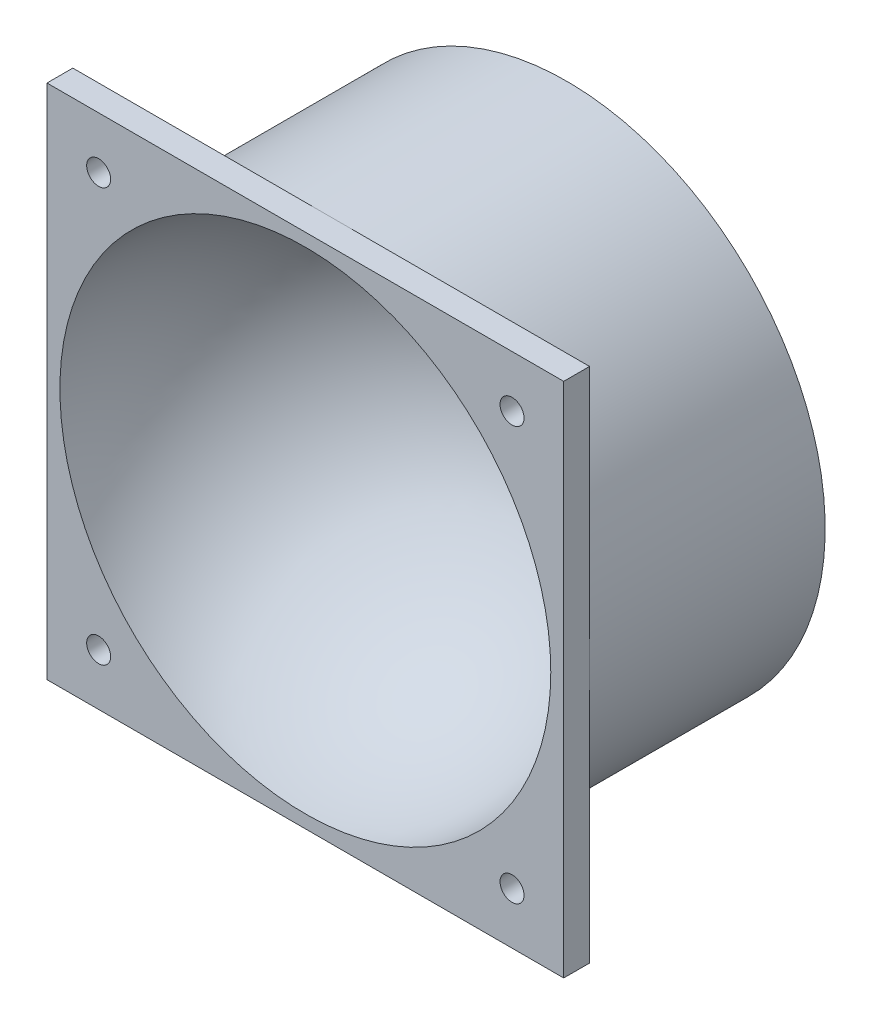
ISO-10303-21;
HEADER;
FILE_DESCRIPTION(('STEP AP214'),'2;1');
FILE_NAME('part.step','',(''),(''),'','','');
FILE_SCHEMA(('AUTOMOTIVE_DESIGN { 1 0 10303 214 1 1 1 1 }'));
ENDSEC;
DATA;
#1=APPLICATION_CONTEXT('core data for automotive mechanical design processes');
#2=APPLICATION_PROTOCOL_DEFINITION('international standard','automotive_design',2000,#1);
#3=PRODUCT_CONTEXT('',#1,'mechanical');
#4=PRODUCT('Part','Part','',(#3));
#5=PRODUCT_RELATED_PRODUCT_CATEGORY('part','',(#4));
#6=PRODUCT_DEFINITION_FORMATION('','',#4);
#7=PRODUCT_DEFINITION_CONTEXT('part definition',#1,'design');
#8=PRODUCT_DEFINITION('design','',#6,#7);
#9=PRODUCT_DEFINITION_SHAPE('','',#8);
#10=(LENGTH_UNIT() NAMED_UNIT(*) SI_UNIT(.MILLI.,.METRE.));
#11=(NAMED_UNIT(*) PLANE_ANGLE_UNIT() SI_UNIT($,.RADIAN.));
#12=(NAMED_UNIT(*) SI_UNIT($,.STERADIAN.) SOLID_ANGLE_UNIT());
#13=UNCERTAINTY_MEASURE_WITH_UNIT(LENGTH_MEASURE(1.E-05),#10,'distance_accuracy_value','');
#14=(GEOMETRIC_REPRESENTATION_CONTEXT(3) GLOBAL_UNCERTAINTY_ASSIGNED_CONTEXT((#13)) GLOBAL_UNIT_ASSIGNED_CONTEXT((#10,
#11,#12)) REPRESENTATION_CONTEXT('',''));
#15=CARTESIAN_POINT('',(0.,0.,0.));
#16=DIRECTION('',(0.,0.,1.));
#17=DIRECTION('',(1.,0.,0.));
#18=AXIS2_PLACEMENT_3D('',#15,#16,#17);
#19=CARTESIAN_POINT('',(0.,0.,3.17499999999998));
#20=DIRECTION('',(0.,0.,-1.));
#21=DIRECTION('',(-1.,0.,0.));
#22=AXIS2_PLACEMENT_3D('',#19,#20,#21);
#23=CYLINDRICAL_SURFACE('',#22,3.2639);
#24=CARTESIAN_POINT('',(0.,0.,-26.8103858244312));
#25=DIRECTION('',(0.,0.,1.));
#26=DIRECTION('',(1.,0.,0.));
#27=AXIS2_PLACEMENT_3D('',#24,#25,#26);
#28=CIRCLE('',#27,3.2639);
#29=CARTESIAN_POINT('',(3.26390000000001,0.,-26.8103858244312));
#30=VERTEX_POINT('',#29);
#31=EDGE_CURVE('E133',#30,#30,#28,.F.);
#32=ORIENTED_EDGE('',*,*,#31,.F.);
#33=EDGE_LOOP('',(#32));
#34=FACE_BOUND('',#33,.T.);
#35=CARTESIAN_POINT('',(0.,0.,-27.432));
#36=DIRECTION('',(0.,0.,-1.));
#37=DIRECTION('',(-1.,0.,0.));
#38=AXIS2_PLACEMENT_3D('',#35,#36,#37);
#39=CIRCLE('',#38,3.2639);
#40=CARTESIAN_POINT('',(-3.26390000000001,0.,-27.432));
#41=VERTEX_POINT('',#40);
#42=EDGE_CURVE('E38',#41,#41,#39,.F.);
#43=ORIENTED_EDGE('',*,*,#42,.F.);
#44=EDGE_LOOP('',(#43));
#45=FACE_BOUND('',#44,.T.);
#46=ADVANCED_FACE('F34',(#34,#45),#23,.F.);
#47=CARTESIAN_POINT('',(-31.75,-31.75,0.));
#48=DIRECTION('',(0.,0.,1.));
#49=DIRECTION('',(1.,0.,0.));
#50=AXIS2_PLACEMENT_3D('',#47,#48,#49);
#51=PLANE('',#50);
#52=CARTESIAN_POINT('',(-25.4,25.4,0.));
#53=DIRECTION('',(0.,0.,1.));
#54=DIRECTION('',(1.,0.,0.));
#55=AXIS2_PLACEMENT_3D('',#52,#53,#54);
#56=CIRCLE('',#55,1.4732);
#57=CARTESIAN_POINT('',(-23.9268,25.4,0.));
#58=VERTEX_POINT('',#57);
#59=EDGE_CURVE('E157',#58,#58,#56,.T.);
#60=ORIENTED_EDGE('',*,*,#59,.T.);
#61=EDGE_LOOP('',(#60));
#62=FACE_BOUND('',#61,.T.);
#63=CARTESIAN_POINT('',(0.,0.,0.));
#64=DIRECTION('',(0.,0.,-1.));
#65=DIRECTION('',(-1.,0.,0.));
#66=AXIS2_PLACEMENT_3D('',#63,#64,#65);
#67=CIRCLE('',#66,31.75);
#68=CARTESIAN_POINT('',(-31.7500000000001,0.,0.));
#69=VERTEX_POINT('',#68);
#70=CARTESIAN_POINT('',(0.,31.75,0.));
#71=VERTEX_POINT('',#70);
#72=EDGE_CURVE('E45',#69,#71,#67,.T.);
#73=ORIENTED_EDGE('',*,*,#72,.F.);
#74=DIRECTION('',(0.,-1.,0.));
#75=VECTOR('',#74,1.);
#76=CARTESIAN_POINT('',(-31.75,31.75,0.));
#77=LINE('',#76,#75);
#78=CARTESIAN_POINT('',(-31.75,31.75,0.));
#79=VERTEX_POINT('',#78);
#80=EDGE_CURVE('E164',#79,#69,#77,.T.);
#81=ORIENTED_EDGE('',*,*,#80,.F.);
#82=DIRECTION('',(-1.,0.,0.));
#83=VECTOR('',#82,1.);
#84=CARTESIAN_POINT('',(-31.75,31.75,0.));
#85=LINE('',#84,#83);
#86=EDGE_CURVE('E174',#71,#79,#85,.T.);
#87=ORIENTED_EDGE('',*,*,#86,.F.);
#88=EDGE_LOOP('',(#73,#81,#87));
#89=FACE_BOUND('',#88,.T.);
#90=ADVANCED_FACE('F207',(#62,#89),#51,.F.);
#91=CARTESIAN_POINT('',(25.4,25.4,0.));
#92=DIRECTION('',(0.,0.,1.));
#93=DIRECTION('',(1.,0.,0.));
#94=AXIS2_PLACEMENT_3D('',#91,#92,#93);
#95=CIRCLE('',#94,1.4732);
#96=CARTESIAN_POINT('',(26.8732,25.4,0.));
#97=VERTEX_POINT('',#96);
#98=EDGE_CURVE('E151',#97,#97,#95,.T.);
#99=ORIENTED_EDGE('',*,*,#98,.T.);
#100=EDGE_LOOP('',(#99));
#101=FACE_BOUND('',#100,.T.);
#102=CARTESIAN_POINT('',(31.7500000000001,0.,0.));
#103=VERTEX_POINT('',#102);
#104=EDGE_CURVE('E11',#71,#103,#67,.T.);
#105=ORIENTED_EDGE('',*,*,#104,.F.);
#106=CARTESIAN_POINT('',(31.7500000000001,31.75,0.));
#107=VERTEX_POINT('',#106);
#108=EDGE_CURVE('E175',#107,#71,#85,.T.);
#109=ORIENTED_EDGE('',*,*,#108,.F.);
#110=DIRECTION('',(0.,1.,0.));
#111=VECTOR('',#110,1.);
#112=CARTESIAN_POINT('',(31.7500000000001,31.75,0.));
#113=LINE('',#112,#111);
#114=EDGE_CURVE('E170',#103,#107,#113,.T.);
#115=ORIENTED_EDGE('',*,*,#114,.F.);
#116=EDGE_LOOP('',(#105,#109,#115));
#117=FACE_BOUND('',#116,.T.);
#118=ADVANCED_FACE('F213',(#101,#117),#51,.F.);
#119=CARTESIAN_POINT('',(25.4000000000001,-25.4,0.));
#120=DIRECTION('',(0.,0.,1.));
#121=DIRECTION('',(1.,0.,0.));
#122=AXIS2_PLACEMENT_3D('',#119,#120,#121);
#123=CIRCLE('',#122,1.4732);
#124=CARTESIAN_POINT('',(26.8732000000001,-25.4,0.));
#125=VERTEX_POINT('',#124);
#126=EDGE_CURVE('E145',#125,#125,#123,.T.);
#127=ORIENTED_EDGE('',*,*,#126,.T.);
#128=EDGE_LOOP('',(#127));
#129=FACE_BOUND('',#128,.T.);
#130=CARTESIAN_POINT('',(0.,-31.75,0.));
#131=VERTEX_POINT('',#130);
#132=EDGE_CURVE('E43',#103,#131,#67,.T.);
#133=ORIENTED_EDGE('',*,*,#132,.F.);
#134=CARTESIAN_POINT('',(31.7500000000001,-31.75,0.));
#135=VERTEX_POINT('',#134);
#136=EDGE_CURVE('E171',#135,#103,#113,.T.);
#137=ORIENTED_EDGE('',*,*,#136,.F.);
#138=DIRECTION('',(1.,0.,0.));
#139=VECTOR('',#138,1.);
#140=CARTESIAN_POINT('',(-31.75,-31.75,0.));
#141=LINE('',#140,#139);
#142=EDGE_CURVE('E166',#131,#135,#141,.T.);
#143=ORIENTED_EDGE('',*,*,#142,.F.);
#144=EDGE_LOOP('',(#133,#137,#143));
#145=FACE_BOUND('',#144,.T.);
#146=ADVANCED_FACE('F279',(#129,#145),#51,.F.);
#147=CARTESIAN_POINT('',(-25.4,-25.4,0.));
#148=DIRECTION('',(0.,0.,1.));
#149=DIRECTION('',(1.,0.,0.));
#150=AXIS2_PLACEMENT_3D('',#147,#148,#149);
#151=CIRCLE('',#150,1.4732);
#152=CARTESIAN_POINT('',(-23.9268,-25.4,0.));
#153=VERTEX_POINT('',#152);
#154=EDGE_CURVE('E139',#153,#153,#151,.T.);
#155=ORIENTED_EDGE('',*,*,#154,.T.);
#156=EDGE_LOOP('',(#155));
#157=FACE_BOUND('',#156,.T.);
#158=EDGE_CURVE('E52',#131,#69,#67,.T.);
#159=ORIENTED_EDGE('',*,*,#158,.F.);
#160=CARTESIAN_POINT('',(-31.75,-31.75,0.));
#161=VERTEX_POINT('',#160);
#162=EDGE_CURVE('E167',#161,#131,#141,.T.);
#163=ORIENTED_EDGE('',*,*,#162,.F.);
#164=EDGE_CURVE('E163',#69,#161,#77,.T.);
#165=ORIENTED_EDGE('',*,*,#164,.F.);
#166=EDGE_LOOP('',(#159,#163,#165));
#167=FACE_BOUND('',#166,.T.);
#168=ADVANCED_FACE('F216',(#157,#167),#51,.F.);
#169=CARTESIAN_POINT('',(-31.75,-31.75,3.17500000000001));
#170=DIRECTION('',(0.,0.,1.));
#171=DIRECTION('',(1.,0.,0.));
#172=AXIS2_PLACEMENT_3D('',#169,#170,#171);
#173=PLANE('',#172);
#174=CARTESIAN_POINT('',(0.,0.,3.17500000000001));
#175=DIRECTION('',(0.,0.,1.));
#176=DIRECTION('',(1.,0.,0.));
#177=AXIS2_PLACEMENT_3D('',#174,#175,#176);
#178=CIRCLE('',#177,30.1625);
#179=CARTESIAN_POINT('',(30.1625000000001,0.,3.17500000000001));
#180=VERTEX_POINT('',#179);
#181=EDGE_CURVE('E131',#180,#180,#178,.T.);
#182=ORIENTED_EDGE('',*,*,#181,.F.);
#183=EDGE_LOOP('',(#182));
#184=FACE_BOUND('',#183,.T.);
#185=CARTESIAN_POINT('',(25.4000000000001,-25.4,3.17500000000001));
#186=DIRECTION('',(0.,0.,1.));
#187=DIRECTION('',(1.,0.,0.));
#188=AXIS2_PLACEMENT_3D('',#185,#186,#187);
#189=CIRCLE('',#188,1.4732);
#190=CARTESIAN_POINT('',(26.8732000000001,-25.4,3.17500000000001));
#191=VERTEX_POINT('',#190);
#192=EDGE_CURVE('E148',#191,#191,#189,.T.);
#193=ORIENTED_EDGE('',*,*,#192,.F.);
#194=EDGE_LOOP('',(#193));
#195=FACE_BOUND('',#194,.T.);
#196=CARTESIAN_POINT('',(-25.4,25.4,3.17500000000001));
#197=DIRECTION('',(0.,0.,1.));
#198=DIRECTION('',(1.,0.,0.));
#199=AXIS2_PLACEMENT_3D('',#196,#197,#198);
#200=CIRCLE('',#199,1.4732);
#201=CARTESIAN_POINT('',(-23.9268,25.4,3.17500000000001));
#202=VERTEX_POINT('',#201);
#203=EDGE_CURVE('E160',#202,#202,#200,.T.);
#204=ORIENTED_EDGE('',*,*,#203,.F.);
#205=EDGE_LOOP('',(#204));
#206=FACE_BOUND('',#205,.T.);
#207=DIRECTION('',(0.,-1.,0.));
#208=VECTOR('',#207,1.);
#209=CARTESIAN_POINT('',(-31.75,31.75,3.17500000000001));
#210=LINE('',#209,#208);
#211=CARTESIAN_POINT('',(-31.75,31.75,3.17500000000001));
#212=VERTEX_POINT('',#211);
#213=CARTESIAN_POINT('',(-31.75,-31.75,3.17500000000001));
#214=VERTEX_POINT('',#213);
#215=EDGE_CURVE('E178',#212,#214,#210,.T.);
#216=ORIENTED_EDGE('',*,*,#215,.T.);
#217=DIRECTION('',(1.,0.,0.));
#218=VECTOR('',#217,1.);
#219=CARTESIAN_POINT('',(-31.75,-31.75,3.17500000000001));
#220=LINE('',#219,#218);
#221=CARTESIAN_POINT('',(31.7500000000001,-31.75,3.17500000000001));
#222=VERTEX_POINT('',#221);
#223=EDGE_CURVE('E181',#214,#222,#220,.T.);
#224=ORIENTED_EDGE('',*,*,#223,.T.);
#225=DIRECTION('',(0.,1.,0.));
#226=VECTOR('',#225,1.);
#227=CARTESIAN_POINT('',(31.7500000000001,31.75,3.17499999999998));
#228=LINE('',#227,#226);
#229=CARTESIAN_POINT('',(31.7500000000001,31.75,3.17499999999998));
#230=VERTEX_POINT('',#229);
#231=EDGE_CURVE('E183',#222,#230,#228,.T.);
#232=ORIENTED_EDGE('',*,*,#231,.T.);
#233=DIRECTION('',(-1.,0.,0.));
#234=VECTOR('',#233,1.);
#235=CARTESIAN_POINT('',(-31.75,31.75,3.17500000000001));
#236=LINE('',#235,#234);
#237=EDGE_CURVE('E185',#230,#212,#236,.T.);
#238=ORIENTED_EDGE('',*,*,#237,.T.);
#239=EDGE_LOOP('',(#216,#224,#232,#238));
#240=FACE_BOUND('',#239,.T.);
#241=CARTESIAN_POINT('',(25.4,25.4,3.17499999999998));
#242=DIRECTION('',(0.,0.,1.));
#243=DIRECTION('',(1.,0.,0.));
#244=AXIS2_PLACEMENT_3D('',#241,#242,#243);
#245=CIRCLE('',#244,1.4732);
#246=CARTESIAN_POINT('',(26.8732,25.4,3.17499999999998));
#247=VERTEX_POINT('',#246);
#248=EDGE_CURVE('E154',#247,#247,#245,.T.);
#249=ORIENTED_EDGE('',*,*,#248,.F.);
#250=EDGE_LOOP('',(#249));
#251=FACE_BOUND('',#250,.T.);
#252=CARTESIAN_POINT('',(-25.4,-25.4,3.17500000000001));
#253=DIRECTION('',(0.,0.,1.));
#254=DIRECTION('',(1.,0.,0.));
#255=AXIS2_PLACEMENT_3D('',#252,#253,#254);
#256=CIRCLE('',#255,1.4732);
#257=CARTESIAN_POINT('',(-23.9268,-25.4,3.17500000000001));
#258=VERTEX_POINT('',#257);
#259=EDGE_CURVE('E142',#258,#258,#256,.T.);
#260=ORIENTED_EDGE('',*,*,#259,.F.);
#261=EDGE_LOOP('',(#260));
#262=FACE_BOUND('',#261,.T.);
#263=ADVANCED_FACE('F249',(#184,#195,#206,#240,#251,#262),#173,.T.);
#264=CARTESIAN_POINT('',(-31.75,31.75,3.17500000000001));
#265=DIRECTION('',(1.,0.,0.));
#266=DIRECTION('',(0.,0.,-1.));
#267=AXIS2_PLACEMENT_3D('',#264,#265,#266);
#268=PLANE('',#267);
#269=ORIENTED_EDGE('',*,*,#80,.T.);
#270=ORIENTED_EDGE('',*,*,#164,.T.);
#271=DIRECTION('',(0.,0.,-1.));
#272=VECTOR('',#271,1.);
#273=CARTESIAN_POINT('',(-31.75,-31.75,3.17500000000001));
#274=LINE('',#273,#272);
#275=EDGE_CURVE('E196',#214,#161,#274,.T.);
#276=ORIENTED_EDGE('',*,*,#275,.F.);
#277=ORIENTED_EDGE('',*,*,#215,.F.);
#278=DIRECTION('',(0.,0.,-1.));
#279=VECTOR('',#278,1.);
#280=CARTESIAN_POINT('',(-31.75,31.75,3.17500000000001));
#281=LINE('',#280,#279);
#282=EDGE_CURVE('E187',#212,#79,#281,.T.);
#283=ORIENTED_EDGE('',*,*,#282,.T.);
#284=EDGE_LOOP('',(#269,#270,#276,#277,#283));
#285=FACE_BOUND('',#284,.T.);
#286=ADVANCED_FACE('F36',(#285),#268,.F.);
#287=CARTESIAN_POINT('',(-31.75,-31.75,3.17500000000001));
#288=DIRECTION('',(0.,1.,0.));
#289=DIRECTION('',(0.,0.,1.));
#290=AXIS2_PLACEMENT_3D('',#287,#288,#289);
#291=PLANE('',#290);
#292=ORIENTED_EDGE('',*,*,#162,.T.);
#293=ORIENTED_EDGE('',*,*,#142,.T.);
#294=DIRECTION('',(0.,0.,-1.));
#295=VECTOR('',#294,1.);
#296=CARTESIAN_POINT('',(31.7500000000001,-31.75,3.17500000000001));
#297=LINE('',#296,#295);
#298=EDGE_CURVE('E193',#222,#135,#297,.T.);
#299=ORIENTED_EDGE('',*,*,#298,.F.);
#300=ORIENTED_EDGE('',*,*,#223,.F.);
#301=ORIENTED_EDGE('',*,*,#275,.T.);
#302=EDGE_LOOP('',(#292,#293,#299,#300,#301));
#303=FACE_BOUND('',#302,.T.);
#304=ADVANCED_FACE('F258',(#303),#291,.F.);
#305=CARTESIAN_POINT('',(31.7500000000001,31.75,3.17499999999998));
#306=DIRECTION('',(-1.,0.,0.));
#307=DIRECTION('',(0.,0.,1.));
#308=AXIS2_PLACEMENT_3D('',#305,#306,#307);
#309=PLANE('',#308);
#310=ORIENTED_EDGE('',*,*,#136,.T.);
#311=ORIENTED_EDGE('',*,*,#114,.T.);
#312=DIRECTION('',(0.,0.,-1.));
#313=VECTOR('',#312,1.);
#314=CARTESIAN_POINT('',(31.7500000000001,31.75,3.17499999999998));
#315=LINE('',#314,#313);
#316=EDGE_CURVE('E190',#230,#107,#315,.T.);
#317=ORIENTED_EDGE('',*,*,#316,.F.);
#318=ORIENTED_EDGE('',*,*,#231,.F.);
#319=ORIENTED_EDGE('',*,*,#298,.T.);
#320=EDGE_LOOP('',(#310,#311,#317,#318,#319));
#321=FACE_BOUND('',#320,.T.);
#322=ADVANCED_FACE('F255',(#321),#309,.F.);
#323=CARTESIAN_POINT('',(-31.75,31.75,3.17500000000001));
#324=DIRECTION('',(0.,-1.,0.));
#325=DIRECTION('',(1.,0.,0.));
#326=AXIS2_PLACEMENT_3D('',#323,#324,#325);
#327=PLANE('',#326);
#328=ORIENTED_EDGE('',*,*,#108,.T.);
#329=ORIENTED_EDGE('',*,*,#86,.T.);
#330=ORIENTED_EDGE('',*,*,#282,.F.);
#331=ORIENTED_EDGE('',*,*,#237,.F.);
#332=ORIENTED_EDGE('',*,*,#316,.T.);
#333=EDGE_LOOP('',(#328,#329,#330,#331,#332));
#334=FACE_BOUND('',#333,.T.);
#335=ADVANCED_FACE('F246',(#334),#327,.F.);
#336=CARTESIAN_POINT('',(-25.4,25.4,3.17500000000001));
#337=DIRECTION('',(0.,0.,-1.));
#338=DIRECTION('',(-1.,0.,0.));
#339=AXIS2_PLACEMENT_3D('',#336,#337,#338);
#340=CYLINDRICAL_SURFACE('',#339,1.4732);
#341=ORIENTED_EDGE('',*,*,#203,.T.);
#342=EDGE_LOOP('',(#341));
#343=FACE_BOUND('',#342,.T.);
#344=ORIENTED_EDGE('',*,*,#59,.F.);
#345=EDGE_LOOP('',(#344));
#346=FACE_BOUND('',#345,.T.);
#347=ADVANCED_FACE('F243',(#343,#346),#340,.F.);
#348=CARTESIAN_POINT('',(25.4,25.4,3.17499999999998));
#349=DIRECTION('',(0.,0.,-1.));
#350=DIRECTION('',(-1.,0.,0.));
#351=AXIS2_PLACEMENT_3D('',#348,#349,#350);
#352=CYLINDRICAL_SURFACE('',#351,1.4732);
#353=ORIENTED_EDGE('',*,*,#248,.T.);
#354=EDGE_LOOP('',(#353));
#355=FACE_BOUND('',#354,.T.);
#356=ORIENTED_EDGE('',*,*,#98,.F.);
#357=EDGE_LOOP('',(#356));
#358=FACE_BOUND('',#357,.T.);
#359=ADVANCED_FACE('F239',(#355,#358),#352,.F.);
#360=CARTESIAN_POINT('',(25.4000000000001,-25.4,3.17500000000001));
#361=DIRECTION('',(0.,0.,-1.));
#362=DIRECTION('',(-1.,0.,0.));
#363=AXIS2_PLACEMENT_3D('',#360,#361,#362);
#364=CYLINDRICAL_SURFACE('',#363,1.4732);
#365=ORIENTED_EDGE('',*,*,#192,.T.);
#366=EDGE_LOOP('',(#365));
#367=FACE_BOUND('',#366,.T.);
#368=ORIENTED_EDGE('',*,*,#126,.F.);
#369=EDGE_LOOP('',(#368));
#370=FACE_BOUND('',#369,.T.);
#371=ADVANCED_FACE('F235',(#367,#370),#364,.F.);
#372=CARTESIAN_POINT('',(-25.4,-25.4,3.17500000000001));
#373=DIRECTION('',(0.,0.,-1.));
#374=DIRECTION('',(-1.,0.,0.));
#375=AXIS2_PLACEMENT_3D('',#372,#373,#374);
#376=CYLINDRICAL_SURFACE('',#375,1.4732);
#377=ORIENTED_EDGE('',*,*,#259,.T.);
#378=EDGE_LOOP('',(#377));
#379=FACE_BOUND('',#378,.T.);
#380=ORIENTED_EDGE('',*,*,#154,.F.);
#381=EDGE_LOOP('',(#380));
#382=FACE_BOUND('',#381,.T.);
#383=ADVANCED_FACE('F231',(#379,#382),#376,.F.);
#384=CARTESIAN_POINT('',(0.,0.,-28.956));
#385=DIRECTION('',(0.,0.,1.));
#386=DIRECTION('',(1.,0.,0.));
#387=AXIS2_PLACEMENT_3D('',#384,#385,#386);
#388=CYLINDRICAL_SURFACE('',#387,31.75);
#389=CARTESIAN_POINT('',(0.,0.,-28.956));
#390=DIRECTION('',(0.,0.,-1.));
#391=DIRECTION('',(-1.,0.,0.));
#392=AXIS2_PLACEMENT_3D('',#389,#390,#391);
#393=CIRCLE('',#392,31.75);
#394=CARTESIAN_POINT('',(-31.7500000000001,0.,-28.956));
#395=VERTEX_POINT('',#394);
#396=EDGE_CURVE('E136',#395,#395,#393,.T.);
#397=ORIENTED_EDGE('',*,*,#396,.F.);
#398=EDGE_LOOP('',(#397));
#399=FACE_BOUND('',#398,.T.);
#400=ORIENTED_EDGE('',*,*,#72,.T.);
#401=ORIENTED_EDGE('',*,*,#104,.T.);
#402=ORIENTED_EDGE('',*,*,#132,.T.);
#403=ORIENTED_EDGE('',*,*,#158,.T.);
#404=EDGE_LOOP('',(#400,#401,#402,#403));
#405=FACE_BOUND('',#404,.T.);
#406=ADVANCED_FACE('F227',(#399,#405),#388,.T.);
#407=CARTESIAN_POINT('',(0.,0.,-28.956));
#408=DIRECTION('',(0.,0.,-1.));
#409=DIRECTION('',(-1.,0.,0.));
#410=AXIS2_PLACEMENT_3D('',#407,#408,#409);
#411=PLANE('',#410);
#412=CARTESIAN_POINT('',(0.,25.4,-28.956));
#413=DIRECTION('',(0.,0.,-1.));
#414=DIRECTION('',(-1.,0.,0.));
#415=AXIS2_PLACEMENT_3D('',#412,#413,#414);
#416=CIRCLE('',#415,1.1303);
#417=CARTESIAN_POINT('',(-1.13029999999999,25.4,-28.956));
#418=VERTEX_POINT('',#417);
#419=EDGE_CURVE('E108',#418,#418,#416,.T.);
#420=ORIENTED_EDGE('',*,*,#419,.F.);
#421=EDGE_LOOP('',(#420));
#422=FACE_BOUND('',#421,.T.);
#423=CARTESIAN_POINT('',(21.9970452561247,-12.7000000000001,-28.956));
#424=DIRECTION('',(0.,0.,-1.));
#425=DIRECTION('',(-1.,0.,0.));
#426=AXIS2_PLACEMENT_3D('',#423,#424,#425);
#427=CIRCLE('',#426,1.1303);
#428=CARTESIAN_POINT('',(20.8667452561247,-12.7000000000001,-28.956));
#429=VERTEX_POINT('',#428);
#430=EDGE_CURVE('E116',#429,#429,#427,.T.);
#431=ORIENTED_EDGE('',*,*,#430,.F.);
#432=EDGE_LOOP('',(#431));
#433=FACE_BOUND('',#432,.T.);
#434=CARTESIAN_POINT('',(-21.9970452561247,-12.7000000000001,-28.956));
#435=DIRECTION('',(0.,0.,-1.));
#436=DIRECTION('',(-1.,0.,0.));
#437=AXIS2_PLACEMENT_3D('',#434,#435,#436);
#438=CIRCLE('',#437,1.1303);
#439=CARTESIAN_POINT('',(-23.1273452561247,-12.7000000000001,-28.956));
#440=VERTEX_POINT('',#439);
#441=EDGE_CURVE('E122',#440,#440,#438,.T.);
#442=ORIENTED_EDGE('',*,*,#441,.F.);
#443=EDGE_LOOP('',(#442));
#444=FACE_BOUND('',#443,.T.);
#445=CARTESIAN_POINT('',(0.,0.,-28.956));
#446=DIRECTION('',(0.,0.,-1.));
#447=DIRECTION('',(-1.,0.,0.));
#448=AXIS2_PLACEMENT_3D('',#445,#446,#447);
#449=CIRCLE('',#448,4.953);
#450=CARTESIAN_POINT('',(-4.95300000000001,0.,-28.956));
#451=VERTEX_POINT('',#450);
#452=EDGE_CURVE('E125',#451,#451,#449,.T.);
#453=ORIENTED_EDGE('',*,*,#452,.F.);
#454=EDGE_LOOP('',(#453));
#455=FACE_BOUND('',#454,.T.);
#456=ORIENTED_EDGE('',*,*,#396,.T.);
#457=EDGE_LOOP('',(#456));
#458=FACE_BOUND('',#457,.T.);
#459=ADVANCED_FACE('F224',(#422,#433,#444,#455,#458),#411,.T.);
#460=CARTESIAN_POINT('',(0.,0.,3.17500000000001));
#461=DIRECTION('',(0.,0.,1.));
#462=DIRECTION('',(1.,0.,0.));
#463=AXIS2_PLACEMENT_3D('',#460,#461,#462);
#464=SPHERICAL_SURFACE('',#463,30.1625);
#465=ORIENTED_EDGE('',*,*,#31,.T.);
#466=EDGE_LOOP('',(#465));
#467=FACE_BOUND('',#466,.T.);
#468=ORIENTED_EDGE('',*,*,#181,.T.);
#469=EDGE_LOOP('',(#468));
#470=FACE_BOUND('',#469,.T.);
#471=ADVANCED_FACE('F221',(#467,#470),#464,.F.);
#472=CARTESIAN_POINT('',(0.,0.,-27.432));
#473=DIRECTION('',(0.,0.,-1.));
#474=DIRECTION('',(-1.,0.,0.));
#475=AXIS2_PLACEMENT_3D('',#472,#473,#474);
#476=PLANE('',#475);
#477=CARTESIAN_POINT('',(0.,0.,-27.432));
#478=DIRECTION('',(0.,0.,-1.));
#479=DIRECTION('',(-1.,0.,0.));
#480=AXIS2_PLACEMENT_3D('',#477,#478,#479);
#481=CIRCLE('',#480,4.953);
#482=CARTESIAN_POINT('',(-4.95300000000001,0.,-27.432));
#483=VERTEX_POINT('',#482);
#484=EDGE_CURVE('E128',#483,#483,#481,.T.);
#485=ORIENTED_EDGE('',*,*,#484,.T.);
#486=EDGE_LOOP('',(#485));
#487=FACE_BOUND('',#486,.T.);
#488=ORIENTED_EDGE('',*,*,#42,.T.);
#489=EDGE_LOOP('',(#488));
#490=FACE_BOUND('',#489,.T.);
#491=ADVANCED_FACE('F204',(#487,#490),#476,.T.);
#492=CARTESIAN_POINT('',(0.,0.,-27.432));
#493=DIRECTION('',(0.,0.,-1.));
#494=DIRECTION('',(-1.,0.,0.));
#495=AXIS2_PLACEMENT_3D('',#492,#493,#494);
#496=CYLINDRICAL_SURFACE('',#495,4.953);
#497=CARTESIAN_POINT('',(-4.95300000000001,0.,-27.432));
#498=CARTESIAN_POINT('',(-4.95300000000001,0.,-27.447875));
#499=CARTESIAN_POINT('',(-4.95300000000001,0.,-27.46375));
#500=CARTESIAN_POINT('',(-4.95300000000001,0.,-27.4955));
#501=CARTESIAN_POINT('',(-4.95300000000001,0.,-27.511375));
#502=CARTESIAN_POINT('',(-4.95300000000001,0.,-27.543125));
#503=CARTESIAN_POINT('',(-4.95300000000001,0.,-27.559));
#504=CARTESIAN_POINT('',(-4.95300000000001,0.,-27.59075));
#505=CARTESIAN_POINT('',(-4.95300000000001,0.,-27.606625));
#506=CARTESIAN_POINT('',(-4.95300000000001,0.,-27.638375));
#507=CARTESIAN_POINT('',(-4.95300000000001,0.,-27.65425));
#508=CARTESIAN_POINT('',(-4.95300000000001,0.,-27.686));
#509=CARTESIAN_POINT('',(-4.95300000000001,0.,-27.701875));
#510=CARTESIAN_POINT('',(-4.95300000000001,0.,-27.733625));
#511=CARTESIAN_POINT('',(-4.95300000000001,0.,-27.7495));
#512=CARTESIAN_POINT('',(-4.95300000000001,0.,-27.78125));
#513=CARTESIAN_POINT('',(-4.95300000000001,0.,-27.797125));
#514=CARTESIAN_POINT('',(-4.95300000000001,0.,-27.828875));
#515=CARTESIAN_POINT('',(-4.95300000000001,0.,-27.84475));
#516=CARTESIAN_POINT('',(-4.95300000000001,0.,-27.8765));
#517=CARTESIAN_POINT('',(-4.95300000000001,0.,-27.892375));
#518=CARTESIAN_POINT('',(-4.95300000000001,0.,-27.924125));
#519=CARTESIAN_POINT('',(-4.95300000000001,0.,-27.94));
#520=CARTESIAN_POINT('',(-4.95300000000001,0.,-27.97175));
#521=CARTESIAN_POINT('',(-4.95300000000001,0.,-27.987625));
#522=CARTESIAN_POINT('',(-4.95300000000001,0.,-28.019375));
#523=CARTESIAN_POINT('',(-4.95300000000001,0.,-28.03525));
#524=CARTESIAN_POINT('',(-4.95300000000001,0.,-28.067));
#525=CARTESIAN_POINT('',(-4.95300000000001,0.,-28.082875));
#526=CARTESIAN_POINT('',(-4.95300000000001,0.,-28.114625));
#527=CARTESIAN_POINT('',(-4.95300000000001,0.,-28.1305));
#528=CARTESIAN_POINT('',(-4.95300000000001,0.,-28.16225));
#529=CARTESIAN_POINT('',(-4.95300000000001,0.,-28.178125));
#530=CARTESIAN_POINT('',(-4.95300000000001,0.,-28.209875));
#531=CARTESIAN_POINT('',(-4.95300000000001,0.,-28.22575));
#532=CARTESIAN_POINT('',(-4.95300000000001,0.,-28.2575));
#533=CARTESIAN_POINT('',(-4.95300000000001,0.,-28.273375));
#534=CARTESIAN_POINT('',(-4.95300000000001,0.,-28.305125));
#535=CARTESIAN_POINT('',(-4.95300000000001,0.,-28.321));
#536=CARTESIAN_POINT('',(-4.95300000000001,0.,-28.35275));
#537=CARTESIAN_POINT('',(-4.95300000000001,0.,-28.368625));
#538=CARTESIAN_POINT('',(-4.95300000000001,0.,-28.400375));
#539=CARTESIAN_POINT('',(-4.95300000000001,0.,-28.41625));
#540=CARTESIAN_POINT('',(-4.95300000000001,0.,-28.448));
#541=CARTESIAN_POINT('',(-4.95300000000001,0.,-28.463875));
#542=CARTESIAN_POINT('',(-4.95300000000001,0.,-28.495625));
#543=CARTESIAN_POINT('',(-4.95300000000001,0.,-28.5115));
#544=CARTESIAN_POINT('',(-4.95300000000001,0.,-28.54325));
#545=CARTESIAN_POINT('',(-4.95300000000001,0.,-28.559125));
#546=CARTESIAN_POINT('',(-4.95300000000001,0.,-28.590875));
#547=CARTESIAN_POINT('',(-4.95300000000001,0.,-28.60675));
#548=CARTESIAN_POINT('',(-4.95300000000001,0.,-28.6385));
#549=CARTESIAN_POINT('',(-4.95300000000001,0.,-28.654375));
#550=CARTESIAN_POINT('',(-4.95300000000001,0.,-28.686125));
#551=CARTESIAN_POINT('',(-4.95300000000001,0.,-28.702));
#552=CARTESIAN_POINT('',(-4.95300000000001,0.,-28.73375));
#553=CARTESIAN_POINT('',(-4.95300000000001,0.,-28.749625));
#554=CARTESIAN_POINT('',(-4.95300000000001,0.,-28.781375));
#555=CARTESIAN_POINT('',(-4.95300000000001,0.,-28.79725));
#556=CARTESIAN_POINT('',(-4.95300000000001,0.,-28.829));
#557=CARTESIAN_POINT('',(-4.95300000000001,0.,-28.844875));
#558=CARTESIAN_POINT('',(-4.95300000000001,0.,-28.876625));
#559=CARTESIAN_POINT('',(-4.95300000000001,0.,-28.8925));
#560=CARTESIAN_POINT('',(-4.95300000000001,0.,-28.92425));
#561=CARTESIAN_POINT('',(-4.95300000000001,0.,-28.940125));
#562=CARTESIAN_POINT('',(-4.95300000000001,0.,-28.956));
#563=B_SPLINE_CURVE_WITH_KNOTS('',3,(#497,#498,#499,#500,#501,#502,#503,#504,#505,#506,#507,
#508,#509,#510,#511,#512,#513,#514,#515,#516,#517,#518,#519,#520,#521,#522,#523,#524,#525,#526,
#527,#528,#529,#530,#531,#532,#533,#534,#535,#536,#537,#538,#539,#540,#541,#542,#543,#544,#545,
#546,#547,#548,#549,#550,#551,#552,#553,#554,#555,#556,#557,#558,#559,#560,#561,#562),
.UNSPECIFIED.,.F.,.F.,(4,2,2,2,2,2,2,2,2,2,2,2,2,2,2,2,2,2,2,2,2,2,2,2,2,2,2,2,2,2,2,2,4),(0.,
0.0476249999999991,0.0952499999999981,0.142874999999997,0.1905,0.238124999999999,
0.285749999999998,0.333374999999997,0.380999999999999,0.428624999999998,0.476249999999998,
0.523874999999997,0.571499999999999,0.619124999999998,0.666749999999997,0.714374999999996,
0.761999999999999,0.809624999999998,0.857249999999997,0.904874999999996,0.952499999999998,
1.000125,1.04775,1.095375,1.143,1.190625,1.23825,1.285875,1.3335,1.381125,1.42875,1.476375,
1.524),.UNSPECIFIED.);
#564=EDGE_CURVE('BSEAM219',#483,#451,#563,.T.);
#565=ORIENTED_EDGE('',*,*,#484,.F.);
#566=ORIENTED_EDGE('',*,*,#452,.T.);
#567=ORIENTED_EDGE('',*,*,#564,.T.);
#568=ORIENTED_EDGE('',*,*,#564,.F.);
#569=EDGE_LOOP('',(#565,#567,#566,#568));
#570=FACE_BOUND('',#569,.T.);
#571=ADVANCED_FACE('F219',(#570),#496,.F.);
#572=CARTESIAN_POINT('',(-21.9970452561247,-12.7000000000001,-28.956));
#573=DIRECTION('',(0.,0.,-1.));
#574=DIRECTION('',(-1.,0.,0.));
#575=AXIS2_PLACEMENT_3D('',#572,#573,#574);
#576=CYLINDRICAL_SURFACE('',#575,1.1303);
#577=CARTESIAN_POINT('',(-21.9970452561247,-12.7000000000001,-21.3614));
#578=DIRECTION('',(0.,0.,-1.));
#579=DIRECTION('',(-1.,0.,0.));
#580=AXIS2_PLACEMENT_3D('',#577,#578,#579);
#581=CIRCLE('',#580,1.1303);
#582=CARTESIAN_POINT('',(-23.1273452561247,-12.7000000000001,-21.3614));
#583=VERTEX_POINT('',#582);
#584=EDGE_CURVE('E119',#583,#583,#581,.T.);
#585=ORIENTED_EDGE('',*,*,#584,.F.);
#586=EDGE_LOOP('',(#585));
#587=FACE_BOUND('',#586,.T.);
#588=ORIENTED_EDGE('',*,*,#441,.T.);
#589=EDGE_LOOP('',(#588));
#590=FACE_BOUND('',#589,.T.);
#591=ADVANCED_FACE('F325',(#587,#590),#576,.F.);
#592=CARTESIAN_POINT('',(-21.9970452561247,-12.7000000000001,-21.3614));
#593=DIRECTION('',(0.,0.,-1.));
#594=DIRECTION('',(-1.,0.,0.));
#595=AXIS2_PLACEMENT_3D('',#592,#593,#594);
#596=CONICAL_SURFACE('',#595,1.1303,1.02974425867665);
#597=CARTESIAN_POINT('',(-21.9970452561247,-12.7000000000001,-20.6822472423132));
#598=VERTEX_POINT('',#597);
#599=VERTEX_LOOP('',#598);
#600=FACE_BOUND('',#599,.T.);
#601=ORIENTED_EDGE('',*,*,#584,.T.);
#602=EDGE_LOOP('',(#601));
#603=FACE_BOUND('',#602,.T.);
#604=ADVANCED_FACE('F334',(#600,#603),#596,.F.);
#605=CARTESIAN_POINT('',(21.9970452561247,-12.7000000000001,-28.956));
#606=DIRECTION('',(0.,0.,-1.));
#607=DIRECTION('',(-1.,0.,0.));
#608=AXIS2_PLACEMENT_3D('',#605,#606,#607);
#609=CYLINDRICAL_SURFACE('',#608,1.1303);
#610=CARTESIAN_POINT('',(21.9970452561247,-12.7000000000001,-21.3614));
#611=DIRECTION('',(0.,0.,-1.));
#612=DIRECTION('',(-1.,0.,0.));
#613=AXIS2_PLACEMENT_3D('',#610,#611,#612);
#614=CIRCLE('',#613,1.1303);
#615=CARTESIAN_POINT('',(20.8667452561247,-12.7000000000001,-21.3614));
#616=VERTEX_POINT('',#615);
#617=EDGE_CURVE('E111',#616,#616,#614,.T.);
#618=ORIENTED_EDGE('',*,*,#617,.F.);
#619=EDGE_LOOP('',(#618));
#620=FACE_BOUND('',#619,.T.);
#621=ORIENTED_EDGE('',*,*,#430,.T.);
#622=EDGE_LOOP('',(#621));
#623=FACE_BOUND('',#622,.T.);
#624=ADVANCED_FACE('F344',(#620,#623),#609,.F.);
#625=CARTESIAN_POINT('',(21.9970452561247,-12.7000000000001,-21.3614));
#626=DIRECTION('',(0.,0.,-1.));
#627=DIRECTION('',(-1.,0.,0.));
#628=AXIS2_PLACEMENT_3D('',#625,#626,#627);
#629=CONICAL_SURFACE('',#628,1.1303,1.02974425867665);
#630=CARTESIAN_POINT('',(21.9970452561247,-12.7000000000001,-20.6822472423132));
#631=VERTEX_POINT('',#630);
#632=VERTEX_LOOP('',#631);
#633=FACE_BOUND('',#632,.T.);
#634=ORIENTED_EDGE('',*,*,#617,.T.);
#635=EDGE_LOOP('',(#634));
#636=FACE_BOUND('',#635,.T.);
#637=ADVANCED_FACE('F353',(#633,#636),#629,.F.);
#638=CARTESIAN_POINT('',(0.,25.4,-28.956));
#639=DIRECTION('',(0.,0.,-1.));
#640=DIRECTION('',(-1.,0.,0.));
#641=AXIS2_PLACEMENT_3D('',#638,#639,#640);
#642=CYLINDRICAL_SURFACE('',#641,1.1303);
#643=CARTESIAN_POINT('',(0.,25.4,-21.3614));
#644=DIRECTION('',(0.,0.,-1.));
#645=DIRECTION('',(-1.,0.,0.));
#646=AXIS2_PLACEMENT_3D('',#643,#644,#645);
#647=CIRCLE('',#646,1.1303);
#648=CARTESIAN_POINT('',(-1.13029999999999,25.4,-21.3614));
#649=VERTEX_POINT('',#648);
#650=EDGE_CURVE('E106',#649,#649,#647,.T.);
#651=ORIENTED_EDGE('',*,*,#650,.F.);
#652=EDGE_LOOP('',(#651));
#653=FACE_BOUND('',#652,.T.);
#654=ORIENTED_EDGE('',*,*,#419,.T.);
#655=EDGE_LOOP('',(#654));
#656=FACE_BOUND('',#655,.T.);
#657=ADVANCED_FACE('F102',(#653,#656),#642,.F.);
#658=CARTESIAN_POINT('',(0.,25.4,-21.3614));
#659=DIRECTION('',(0.,0.,-1.));
#660=DIRECTION('',(-1.,0.,0.));
#661=AXIS2_PLACEMENT_3D('',#658,#659,#660);
#662=CONICAL_SURFACE('',#661,1.1303,1.02974425867665);
#663=CARTESIAN_POINT('',(0.,25.4,-20.6822472423132));
#664=VERTEX_POINT('',#663);
#665=VERTEX_LOOP('',#664);
#666=FACE_BOUND('',#665,.T.);
#667=ORIENTED_EDGE('',*,*,#650,.T.);
#668=EDGE_LOOP('',(#667));
#669=FACE_BOUND('',#668,.T.);
#670=ADVANCED_FACE('F99',(#666,#669),#662,.F.);
#671=CLOSED_SHELL('',(#46,#90,#118,#146,#168,#263,#286,#304,#322,#335,#347,#359,#371,#383,#406,
#459,#471,#491,#571,#591,#604,#624,#637,#657,#670));
#672=MANIFOLD_SOLID_BREP('B2',#671);
#673=ADVANCED_BREP_SHAPE_REPRESENTATION('',(#18,#672),#14);
#674=SHAPE_DEFINITION_REPRESENTATION(#9,#673);
ENDSEC;
END-ISO-10303-21;
